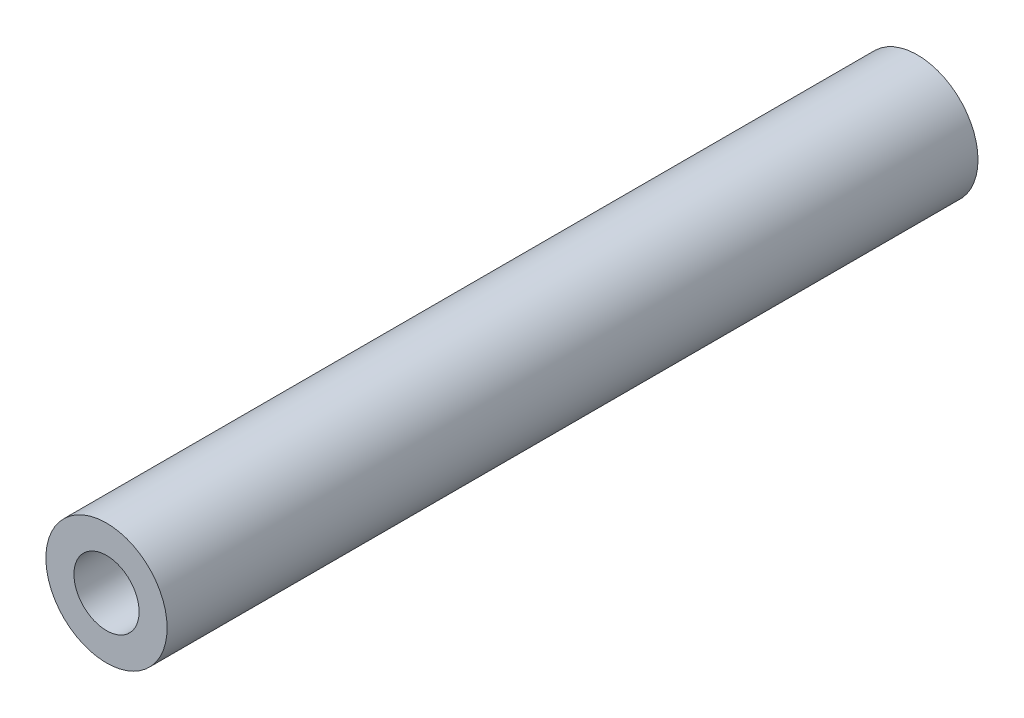
ISO-10303-21;
HEADER;
FILE_DESCRIPTION(('STEP AP214'),'2;1');
FILE_NAME('part.step','',(''),(''),'','','');
FILE_SCHEMA(('AUTOMOTIVE_DESIGN { 1 0 10303 214 1 1 1 1 }'));
ENDSEC;
DATA;
#1=APPLICATION_CONTEXT('core data for automotive mechanical design processes');
#2=APPLICATION_PROTOCOL_DEFINITION('international standard','automotive_design',2000,#1);
#3=PRODUCT_CONTEXT('',#1,'mechanical');
#4=PRODUCT('Part','Part','',(#3));
#5=PRODUCT_RELATED_PRODUCT_CATEGORY('part','',(#4));
#6=PRODUCT_DEFINITION_FORMATION('','',#4);
#7=PRODUCT_DEFINITION_CONTEXT('part definition',#1,'design');
#8=PRODUCT_DEFINITION('design','',#6,#7);
#9=PRODUCT_DEFINITION_SHAPE('','',#8);
#10=(LENGTH_UNIT() NAMED_UNIT(*) SI_UNIT(.MILLI.,.METRE.));
#11=(NAMED_UNIT(*) PLANE_ANGLE_UNIT() SI_UNIT($,.RADIAN.));
#12=(NAMED_UNIT(*) SI_UNIT($,.STERADIAN.) SOLID_ANGLE_UNIT());
#13=UNCERTAINTY_MEASURE_WITH_UNIT(LENGTH_MEASURE(1.E-05),#10,'distance_accuracy_value','');
#14=(GEOMETRIC_REPRESENTATION_CONTEXT(3) GLOBAL_UNCERTAINTY_ASSIGNED_CONTEXT((#13)) GLOBAL_UNIT_ASSIGNED_CONTEXT((#10,
#11,#12)) REPRESENTATION_CONTEXT('',''));
#15=CARTESIAN_POINT('',(0.,0.,0.));
#16=DIRECTION('',(0.,0.,1.));
#17=DIRECTION('',(1.,0.,0.));
#18=AXIS2_PLACEMENT_3D('',#15,#16,#17);
#19=CARTESIAN_POINT('',(0.,0.,53.5));
#20=DIRECTION('',(0.,0.,1.));
#21=DIRECTION('',(1.,0.,0.));
#22=AXIS2_PLACEMENT_3D('',#19,#20,#21);
#23=PLANE('',#22);
#24=CARTESIAN_POINT('',(0.,0.,53.5));
#25=DIRECTION('',(0.,0.,1.));
#26=DIRECTION('',(1.,0.,0.));
#27=AXIS2_PLACEMENT_3D('',#24,#25,#26);
#28=CIRCLE('',#27,4.);
#29=CARTESIAN_POINT('',(4.,0.,53.5));
#30=VERTEX_POINT('',#29);
#31=EDGE_CURVE('E10',#30,#30,#28,.T.);
#32=ORIENTED_EDGE('',*,*,#31,.T.);
#33=EDGE_LOOP('',(#32));
#34=FACE_BOUND('',#33,.T.);
#35=CARTESIAN_POINT('',(0.,0.,53.5));
#36=DIRECTION('',(0.,0.,1.));
#37=DIRECTION('',(1.,0.,0.));
#38=AXIS2_PLACEMENT_3D('',#35,#36,#37);
#39=CIRCLE('',#38,2.15);
#40=CARTESIAN_POINT('',(2.15,0.,53.5));
#41=VERTEX_POINT('',#40);
#42=EDGE_CURVE('E53',#41,#41,#39,.T.);
#43=ORIENTED_EDGE('',*,*,#42,.F.);
#44=EDGE_LOOP('',(#43));
#45=FACE_BOUND('',#44,.T.);
#46=ADVANCED_FACE('F40',(#34,#45),#23,.T.);
#47=CARTESIAN_POINT('',(0.,0.,0.));
#48=DIRECTION('',(0.,0.,1.));
#49=DIRECTION('',(1.,0.,0.));
#50=AXIS2_PLACEMENT_3D('',#47,#48,#49);
#51=PLANE('',#50);
#52=CARTESIAN_POINT('',(0.,0.,0.));
#53=DIRECTION('',(0.,0.,1.));
#54=DIRECTION('',(1.,0.,0.));
#55=AXIS2_PLACEMENT_3D('',#52,#53,#54);
#56=CIRCLE('',#55,4.);
#57=CARTESIAN_POINT('',(4.,0.,0.));
#58=VERTEX_POINT('',#57);
#59=EDGE_CURVE('E44',#58,#58,#56,.T.);
#60=ORIENTED_EDGE('',*,*,#59,.F.);
#61=EDGE_LOOP('',(#60));
#62=FACE_BOUND('',#61,.T.);
#63=CARTESIAN_POINT('',(0.,0.,0.));
#64=DIRECTION('',(0.,0.,1.));
#65=DIRECTION('',(1.,0.,0.));
#66=AXIS2_PLACEMENT_3D('',#63,#64,#65);
#67=CIRCLE('',#66,2.15);
#68=CARTESIAN_POINT('',(2.15,0.,0.));
#69=VERTEX_POINT('',#68);
#70=EDGE_CURVE('E55',#69,#69,#67,.T.);
#71=ORIENTED_EDGE('',*,*,#70,.T.);
#72=EDGE_LOOP('',(#71));
#73=FACE_BOUND('',#72,.T.);
#74=ADVANCED_FACE('F67',(#62,#73),#51,.F.);
#75=CARTESIAN_POINT('',(0.,0.,53.5));
#76=DIRECTION('',(0.,0.,-1.));
#77=DIRECTION('',(-1.,0.,0.));
#78=AXIS2_PLACEMENT_3D('',#75,#76,#77);
#79=CYLINDRICAL_SURFACE('',#78,4.);
#80=ORIENTED_EDGE('',*,*,#31,.F.);
#81=EDGE_LOOP('',(#80));
#82=FACE_BOUND('',#81,.T.);
#83=ORIENTED_EDGE('',*,*,#59,.T.);
#84=EDGE_LOOP('',(#83));
#85=FACE_BOUND('',#84,.T.);
#86=ADVANCED_FACE('F42',(#82,#85),#79,.T.);
#87=CARTESIAN_POINT('',(0.,0.,53.5));
#88=DIRECTION('',(0.,0.,-1.));
#89=DIRECTION('',(-1.,0.,0.));
#90=AXIS2_PLACEMENT_3D('',#87,#88,#89);
#91=CYLINDRICAL_SURFACE('',#90,2.15);
#92=ORIENTED_EDGE('',*,*,#42,.T.);
#93=EDGE_LOOP('',(#92));
#94=FACE_BOUND('',#93,.T.);
#95=ORIENTED_EDGE('',*,*,#70,.F.);
#96=EDGE_LOOP('',(#95));
#97=FACE_BOUND('',#96,.T.);
#98=ADVANCED_FACE('F63',(#94,#97),#91,.F.);
#99=CLOSED_SHELL('',(#46,#74,#86,#98));
#100=MANIFOLD_SOLID_BREP('B2',#99);
#101=ADVANCED_BREP_SHAPE_REPRESENTATION('',(#18,#100),#14);
#102=SHAPE_DEFINITION_REPRESENTATION(#9,#101);
ENDSEC;
END-ISO-10303-21;
